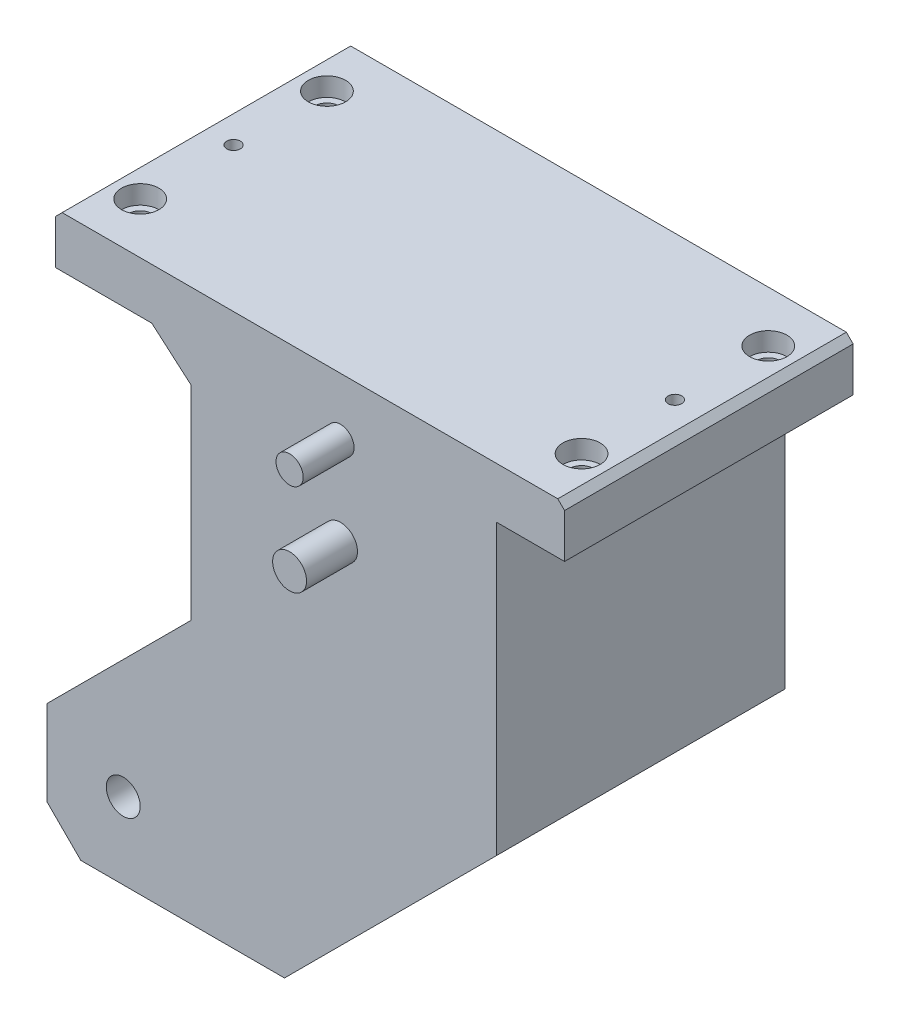
ISO-10303-21;
HEADER;
FILE_DESCRIPTION(('STEP AP214'),'2;1');
FILE_NAME('part.step','',(''),(''),'','','');
FILE_SCHEMA(('AUTOMOTIVE_DESIGN { 1 0 10303 214 1 1 1 1 }'));
ENDSEC;
DATA;
#1=APPLICATION_CONTEXT('core data for automotive mechanical design processes');
#2=APPLICATION_PROTOCOL_DEFINITION('international standard','automotive_design',2000,#1);
#3=PRODUCT_CONTEXT('',#1,'mechanical');
#4=PRODUCT('Part','Part','',(#3));
#5=PRODUCT_RELATED_PRODUCT_CATEGORY('part','',(#4));
#6=PRODUCT_DEFINITION_FORMATION('','',#4);
#7=PRODUCT_DEFINITION_CONTEXT('part definition',#1,'design');
#8=PRODUCT_DEFINITION('design','',#6,#7);
#9=PRODUCT_DEFINITION_SHAPE('','',#8);
#10=(LENGTH_UNIT() NAMED_UNIT(*) SI_UNIT(.MILLI.,.METRE.));
#11=(NAMED_UNIT(*) PLANE_ANGLE_UNIT() SI_UNIT($,.RADIAN.));
#12=(NAMED_UNIT(*) SI_UNIT($,.STERADIAN.) SOLID_ANGLE_UNIT());
#13=UNCERTAINTY_MEASURE_WITH_UNIT(LENGTH_MEASURE(1.E-05),#10,'distance_accuracy_value','');
#14=(GEOMETRIC_REPRESENTATION_CONTEXT(3) GLOBAL_UNCERTAINTY_ASSIGNED_CONTEXT((#13)) GLOBAL_UNIT_ASSIGNED_CONTEXT((#10,
#11,#12)) REPRESENTATION_CONTEXT('',''));
#15=CARTESIAN_POINT('',(0.,0.,0.));
#16=DIRECTION('',(0.,0.,1.));
#17=DIRECTION('',(1.,0.,0.));
#18=AXIS2_PLACEMENT_3D('',#15,#16,#17);
#19=CARTESIAN_POINT('',(56.0000000000004,15.,-15.));
#20=DIRECTION('',(0.,1.,0.));
#21=DIRECTION('',(-1.,0.,0.));
#22=AXIS2_PLACEMENT_3D('',#19,#20,#21);
#23=CYLINDRICAL_SURFACE('',#22,3.50000000000001);
#24=CARTESIAN_POINT('',(56.0000000000004,28.,-15.));
#25=DIRECTION('',(0.,-1.,0.));
#26=DIRECTION('',(0.,0.,-1.));
#27=AXIS2_PLACEMENT_3D('',#24,#25,#26);
#28=CIRCLE('',#27,3.50000000000001);
#29=CARTESIAN_POINT('',(56.0000000000004,28.,-18.5));
#30=VERTEX_POINT('',#29);
#31=EDGE_CURVE('E268',#30,#30,#28,.F.);
#32=ORIENTED_EDGE('',*,*,#31,.F.);
#33=EDGE_LOOP('',(#32));
#34=FACE_BOUND('',#33,.T.);
#35=CARTESIAN_POINT('',(56.0000000000004,37.5,-15.));
#36=DIRECTION('',(0.,1.,0.));
#37=DIRECTION('',(-1.,0.,0.));
#38=AXIS2_PLACEMENT_3D('',#35,#36,#37);
#39=CIRCLE('',#38,3.50000000000001);
#40=CARTESIAN_POINT('',(52.5000000000004,37.5,-15.));
#41=VERTEX_POINT('',#40);
#42=EDGE_CURVE('E39',#41,#41,#39,.T.);
#43=ORIENTED_EDGE('',*,*,#42,.T.);
#44=EDGE_LOOP('',(#43));
#45=FACE_BOUND('',#44,.T.);
#46=ADVANCED_FACE('F35',(#34,#45),#23,.F.);
#47=CARTESIAN_POINT('',(56.0000000000004,15.,-70.));
#48=DIRECTION('',(0.,1.,0.));
#49=DIRECTION('',(-1.,0.,0.));
#50=AXIS2_PLACEMENT_3D('',#47,#48,#49);
#51=CYLINDRICAL_SURFACE('',#50,3.50000000000001);
#52=CARTESIAN_POINT('',(56.0000000000004,28.,-70.));
#53=DIRECTION('',(0.,-1.,0.));
#54=DIRECTION('',(0.,0.,-1.));
#55=AXIS2_PLACEMENT_3D('',#52,#53,#54);
#56=CIRCLE('',#55,3.50000000000001);
#57=CARTESIAN_POINT('',(56.0000000000004,28.,-73.5));
#58=VERTEX_POINT('',#57);
#59=EDGE_CURVE('E260',#58,#58,#56,.F.);
#60=ORIENTED_EDGE('',*,*,#59,.F.);
#61=EDGE_LOOP('',(#60));
#62=FACE_BOUND('',#61,.T.);
#63=CARTESIAN_POINT('',(56.0000000000004,37.5,-70.));
#64=DIRECTION('',(0.,1.,0.));
#65=DIRECTION('',(-1.,0.,0.));
#66=AXIS2_PLACEMENT_3D('',#63,#64,#65);
#67=CIRCLE('',#66,3.50000000000001);
#68=CARTESIAN_POINT('',(52.5000000000004,37.5,-70.));
#69=VERTEX_POINT('',#68);
#70=EDGE_CURVE('E270',#69,#69,#67,.T.);
#71=ORIENTED_EDGE('',*,*,#70,.T.);
#72=EDGE_LOOP('',(#71));
#73=FACE_BOUND('',#72,.T.);
#74=ADVANCED_FACE('F400',(#62,#73),#51,.F.);
#75=CARTESIAN_POINT('',(-73.9999999999995,15.,-15.));
#76=DIRECTION('',(0.,1.,0.));
#77=DIRECTION('',(-1.,0.,0.));
#78=AXIS2_PLACEMENT_3D('',#75,#76,#77);
#79=CYLINDRICAL_SURFACE('',#78,3.50000000000001);
#80=CARTESIAN_POINT('',(-73.9999999999995,28.,-15.));
#81=DIRECTION('',(0.,-1.,0.));
#82=DIRECTION('',(0.,0.,-1.));
#83=AXIS2_PLACEMENT_3D('',#80,#81,#82);
#84=CIRCLE('',#83,3.50000000000001);
#85=CARTESIAN_POINT('',(-73.9999999999995,28.,-18.5));
#86=VERTEX_POINT('',#85);
#87=EDGE_CURVE('E253',#86,#86,#84,.T.);
#88=ORIENTED_EDGE('',*,*,#87,.T.);
#89=EDGE_LOOP('',(#88));
#90=FACE_BOUND('',#89,.T.);
#91=CARTESIAN_POINT('',(-73.9999999999995,37.5,-15.));
#92=DIRECTION('',(0.,1.,0.));
#93=DIRECTION('',(-1.,0.,0.));
#94=AXIS2_PLACEMENT_3D('',#91,#92,#93);
#95=CIRCLE('',#94,3.50000000000001);
#96=CARTESIAN_POINT('',(-77.4999999999995,37.5,-15.));
#97=VERTEX_POINT('',#96);
#98=EDGE_CURVE('E255',#97,#97,#95,.F.);
#99=ORIENTED_EDGE('',*,*,#98,.F.);
#100=EDGE_LOOP('',(#99));
#101=FACE_BOUND('',#100,.T.);
#102=ADVANCED_FACE('F406',(#90,#101),#79,.F.);
#103=CARTESIAN_POINT('',(-73.9999999999995,15.,-70.));
#104=DIRECTION('',(0.,1.,0.));
#105=DIRECTION('',(-1.,0.,0.));
#106=AXIS2_PLACEMENT_3D('',#103,#104,#105);
#107=CYLINDRICAL_SURFACE('',#106,3.50000000000001);
#108=CARTESIAN_POINT('',(-73.9999999999995,28.,-70.));
#109=DIRECTION('',(0.,-1.,0.));
#110=DIRECTION('',(0.,0.,-1.));
#111=AXIS2_PLACEMENT_3D('',#108,#109,#110);
#112=CIRCLE('',#111,3.50000000000001);
#113=CARTESIAN_POINT('',(-73.9999999999995,28.,-73.5));
#114=VERTEX_POINT('',#113);
#115=EDGE_CURVE('E304',#114,#114,#112,.T.);
#116=ORIENTED_EDGE('',*,*,#115,.T.);
#117=EDGE_LOOP('',(#116));
#118=FACE_BOUND('',#117,.T.);
#119=CARTESIAN_POINT('',(-73.9999999999995,37.5,-70.));
#120=DIRECTION('',(0.,1.,0.));
#121=DIRECTION('',(-1.,0.,0.));
#122=AXIS2_PLACEMENT_3D('',#119,#120,#121);
#123=CIRCLE('',#122,3.50000000000001);
#124=CARTESIAN_POINT('',(-77.4999999999995,37.5,-70.));
#125=VERTEX_POINT('',#124);
#126=EDGE_CURVE('E250',#125,#125,#123,.F.);
#127=ORIENTED_EDGE('',*,*,#126,.F.);
#128=EDGE_LOOP('',(#127));
#129=FACE_BOUND('',#128,.T.);
#130=ADVANCED_FACE('F395',(#118,#129),#107,.F.);
#131=CARTESIAN_POINT('',(-9.84077551068508,-11.4243300947287,-85.));
#132=DIRECTION('',(-0.652643387485077,-0.757665235293268,0.));
#133=DIRECTION('',(0.757665235293268,-0.652643387485077,0.));
#134=AXIS2_PLACEMENT_3D('',#131,#132,#133);
#135=PLANE('',#134);
#136=DIRECTION('',(0.757665235293268,-0.652643387485077,0.));
#137=VECTOR('',#136,1.);
#138=CARTESIAN_POINT('',(-9.84077551068508,-11.4243300947287,0.));
#139=LINE('',#138,#137);
#140=CARTESIAN_POINT('',(-55.6091766165418,28.,0.));
#141=VERTEX_POINT('',#140);
#142=CARTESIAN_POINT('',(-43.9999999999995,18.,0.));
#143=VERTEX_POINT('',#142);
#144=EDGE_CURVE('E180',#141,#143,#139,.T.);
#145=ORIENTED_EDGE('',*,*,#144,.F.);
#146=DIRECTION('',(0.,0.,1.));
#147=VECTOR('',#146,1.);
#148=CARTESIAN_POINT('',(-55.6091766165418,28.,-85.));
#149=LINE('',#148,#147);
#150=CARTESIAN_POINT('',(-55.6091766165418,28.,-85.));
#151=VERTEX_POINT('',#150);
#152=EDGE_CURVE('E11',#151,#141,#149,.T.);
#153=ORIENTED_EDGE('',*,*,#152,.F.);
#154=DIRECTION('',(0.757665235293268,-0.652643387485077,0.));
#155=VECTOR('',#154,1.);
#156=CARTESIAN_POINT('',(-9.84077551068508,-11.4243300947287,-85.));
#157=LINE('',#156,#155);
#158=CARTESIAN_POINT('',(-43.9999999999995,18.,-85.));
#159=VERTEX_POINT('',#158);
#160=EDGE_CURVE('E225',#151,#159,#157,.T.);
#161=ORIENTED_EDGE('',*,*,#160,.T.);
#162=DIRECTION('',(0.,0.,1.));
#163=VECTOR('',#162,1.);
#164=CARTESIAN_POINT('',(-43.9999999999995,18.,-85.));
#165=LINE('',#164,#163);
#166=EDGE_CURVE('E113',#159,#143,#165,.T.);
#167=ORIENTED_EDGE('',*,*,#166,.T.);
#168=EDGE_LOOP('',(#145,#153,#161,#167));
#169=FACE_BOUND('',#168,.T.);
#170=ADVANCED_FACE('F37',(#169),#135,.T.);
#171=CARTESIAN_POINT('',(0.,28.,-85.));
#172=DIRECTION('',(0.,-1.,0.));
#173=DIRECTION('',(0.,0.,-1.));
#174=AXIS2_PLACEMENT_3D('',#171,#172,#173);
#175=PLANE('',#174);
#176=ORIENTED_EDGE('',*,*,#87,.F.);
#177=EDGE_LOOP('',(#176));
#178=FACE_BOUND('',#177,.T.);
#179=CARTESIAN_POINT('',(-73.9999999999995,28.,-42.5));
#180=DIRECTION('',(0.,-1.,0.));
#181=DIRECTION('',(0.,0.,-1.));
#182=AXIS2_PLACEMENT_3D('',#179,#180,#181);
#183=CIRCLE('',#182,2.);
#184=CARTESIAN_POINT('',(-73.9999999999995,28.,-44.5));
#185=VERTEX_POINT('',#184);
#186=EDGE_CURVE('E301',#185,#185,#183,.T.);
#187=ORIENTED_EDGE('',*,*,#186,.F.);
#188=EDGE_LOOP('',(#187));
#189=FACE_BOUND('',#188,.T.);
#190=ORIENTED_EDGE('',*,*,#115,.F.);
#191=EDGE_LOOP('',(#190));
#192=FACE_BOUND('',#191,.T.);
#193=DIRECTION('',(1.,0.,0.));
#194=VECTOR('',#193,1.);
#195=CARTESIAN_POINT('',(0.,28.,0.));
#196=LINE('',#195,#194);
#197=CARTESIAN_POINT('',(-83.9999999999995,28.,0.));
#198=VERTEX_POINT('',#197);
#199=EDGE_CURVE('E220',#198,#141,#196,.T.);
#200=ORIENTED_EDGE('',*,*,#199,.F.);
#201=DIRECTION('',(0.,0.,1.));
#202=VECTOR('',#201,1.);
#203=CARTESIAN_POINT('',(-83.9999999999995,28.,-85.));
#204=LINE('',#203,#202);
#205=CARTESIAN_POINT('',(-83.9999999999995,28.,-85.));
#206=VERTEX_POINT('',#205);
#207=EDGE_CURVE('E45',#206,#198,#204,.T.);
#208=ORIENTED_EDGE('',*,*,#207,.F.);
#209=DIRECTION('',(1.,0.,0.));
#210=VECTOR('',#209,1.);
#211=CARTESIAN_POINT('',(0.,28.,-85.));
#212=LINE('',#211,#210);
#213=EDGE_CURVE('E167',#206,#151,#212,.T.);
#214=ORIENTED_EDGE('',*,*,#213,.T.);
#215=ORIENTED_EDGE('',*,*,#152,.T.);
#216=EDGE_LOOP('',(#200,#208,#214,#215));
#217=FACE_BOUND('',#216,.T.);
#218=ADVANCED_FACE('F386',(#178,#189,#192,#217),#175,.T.);
#219=CARTESIAN_POINT('',(-83.9999999999995,0.,-85.));
#220=DIRECTION('',(-1.,0.,0.));
#221=DIRECTION('',(0.,0.,1.));
#222=AXIS2_PLACEMENT_3D('',#219,#220,#221);
#223=PLANE('',#222);
#224=DIRECTION('',(0.,-1.,0.));
#225=VECTOR('',#224,1.);
#226=CARTESIAN_POINT('',(-83.9999999999995,0.,0.));
#227=LINE('',#226,#225);
#228=CARTESIAN_POINT('',(-83.9999999999995,41.,0.));
#229=VERTEX_POINT('',#228);
#230=EDGE_CURVE('E153',#229,#198,#227,.T.);
#231=ORIENTED_EDGE('',*,*,#230,.F.);
#232=DIRECTION('',(0.,0.,1.));
#233=VECTOR('',#232,1.);
#234=CARTESIAN_POINT('',(-83.9999999999995,41.,-85.));
#235=LINE('',#234,#233);
#236=CARTESIAN_POINT('',(-83.9999999999995,41.,-85.));
#237=VERTEX_POINT('',#236);
#238=EDGE_CURVE('E148',#237,#229,#235,.T.);
#239=ORIENTED_EDGE('',*,*,#238,.F.);
#240=DIRECTION('',(0.,-1.,0.));
#241=VECTOR('',#240,1.);
#242=CARTESIAN_POINT('',(-83.9999999999995,0.,-85.));
#243=LINE('',#242,#241);
#244=EDGE_CURVE('E151',#237,#206,#243,.T.);
#245=ORIENTED_EDGE('',*,*,#244,.T.);
#246=ORIENTED_EDGE('',*,*,#207,.T.);
#247=EDGE_LOOP('',(#231,#239,#245,#246));
#248=FACE_BOUND('',#247,.T.);
#249=ADVANCED_FACE('F150',(#248),#223,.T.);
#250=CARTESIAN_POINT('',(-62.4999999999999,62.4999999999997,-85.));
#251=DIRECTION('',(-0.707106781186549,0.707106781186546,0.));
#252=DIRECTION('',(-0.707106781186546,-0.707106781186549,0.));
#253=AXIS2_PLACEMENT_3D('',#250,#251,#252);
#254=PLANE('',#253);
#255=DIRECTION('',(-0.707106781186546,-0.707106781186549,0.));
#256=VECTOR('',#255,1.);
#257=CARTESIAN_POINT('',(-62.4999999999999,62.4999999999997,0.));
#258=LINE('',#257,#256);
#259=CARTESIAN_POINT('',(-81.9999999999995,43.,0.));
#260=VERTEX_POINT('',#259);
#261=EDGE_CURVE('E217',#260,#229,#258,.T.);
#262=ORIENTED_EDGE('',*,*,#261,.F.);
#263=DIRECTION('',(0.,0.,1.));
#264=VECTOR('',#263,1.);
#265=CARTESIAN_POINT('',(-81.9999999999995,43.,-85.));
#266=LINE('',#265,#264);
#267=CARTESIAN_POINT('',(-81.9999999999995,43.,-85.));
#268=VERTEX_POINT('',#267);
#269=EDGE_CURVE('E158',#268,#260,#266,.T.);
#270=ORIENTED_EDGE('',*,*,#269,.F.);
#271=DIRECTION('',(-0.707106781186546,-0.707106781186549,0.));
#272=VECTOR('',#271,1.);
#273=CARTESIAN_POINT('',(-62.4999999999999,62.4999999999997,-85.));
#274=LINE('',#273,#272);
#275=EDGE_CURVE('E165',#268,#237,#274,.T.);
#276=ORIENTED_EDGE('',*,*,#275,.T.);
#277=ORIENTED_EDGE('',*,*,#238,.T.);
#278=EDGE_LOOP('',(#262,#270,#276,#277));
#279=FACE_BOUND('',#278,.T.);
#280=ADVANCED_FACE('F169',(#279),#254,.T.);
#281=CARTESIAN_POINT('',(0.,43.,-85.));
#282=DIRECTION('',(0.,1.,0.));
#283=DIRECTION('',(-1.,0.,0.));
#284=AXIS2_PLACEMENT_3D('',#281,#282,#283);
#285=PLANE('',#284);
#286=CARTESIAN_POINT('',(56.0000000000004,43.,-15.));
#287=DIRECTION('',(0.,-1.,0.));
#288=DIRECTION('',(1.,0.,0.));
#289=AXIS2_PLACEMENT_3D('',#286,#287,#288);
#290=CIRCLE('',#289,5.5);
#291=CARTESIAN_POINT('',(61.5000000000004,43.,-15.));
#292=VERTEX_POINT('',#291);
#293=EDGE_CURVE('E283',#292,#292,#290,.T.);
#294=ORIENTED_EDGE('',*,*,#293,.T.);
#295=EDGE_LOOP('',(#294));
#296=FACE_BOUND('',#295,.T.);
#297=CARTESIAN_POINT('',(56.0000000000004,43.,-70.));
#298=DIRECTION('',(0.,-1.,0.));
#299=DIRECTION('',(1.,0.,0.));
#300=AXIS2_PLACEMENT_3D('',#297,#298,#299);
#301=CIRCLE('',#300,5.5);
#302=CARTESIAN_POINT('',(61.5000000000004,43.,-70.));
#303=VERTEX_POINT('',#302);
#304=EDGE_CURVE('E276',#303,#303,#301,.T.);
#305=ORIENTED_EDGE('',*,*,#304,.T.);
#306=EDGE_LOOP('',(#305));
#307=FACE_BOUND('',#306,.T.);
#308=CARTESIAN_POINT('',(56.0000000000004,43.,-42.5));
#309=DIRECTION('',(0.,-1.,0.));
#310=DIRECTION('',(1.,0.,0.));
#311=AXIS2_PLACEMENT_3D('',#308,#309,#310);
#312=CIRCLE('',#311,2.);
#313=CARTESIAN_POINT('',(58.0000000000004,43.,-42.5));
#314=VERTEX_POINT('',#313);
#315=EDGE_CURVE('E267',#314,#314,#312,.T.);
#316=ORIENTED_EDGE('',*,*,#315,.T.);
#317=EDGE_LOOP('',(#316));
#318=FACE_BOUND('',#317,.T.);
#319=CARTESIAN_POINT('',(-73.9999999999995,43.,-15.));
#320=DIRECTION('',(0.,1.,0.));
#321=DIRECTION('',(-1.,0.,0.));
#322=AXIS2_PLACEMENT_3D('',#319,#320,#321);
#323=CIRCLE('',#322,5.5);
#324=CARTESIAN_POINT('',(-79.4999999999995,43.,-15.));
#325=VERTEX_POINT('',#324);
#326=EDGE_CURVE('E263',#325,#325,#323,.T.);
#327=ORIENTED_EDGE('',*,*,#326,.F.);
#328=EDGE_LOOP('',(#327));
#329=FACE_BOUND('',#328,.T.);
#330=CARTESIAN_POINT('',(-73.9999999999995,43.,-70.));
#331=DIRECTION('',(0.,1.,0.));
#332=DIRECTION('',(-1.,0.,0.));
#333=AXIS2_PLACEMENT_3D('',#330,#331,#332);
#334=CIRCLE('',#333,5.5);
#335=CARTESIAN_POINT('',(-79.4999999999995,43.,-70.));
#336=VERTEX_POINT('',#335);
#337=EDGE_CURVE('E258',#336,#336,#334,.T.);
#338=ORIENTED_EDGE('',*,*,#337,.F.);
#339=EDGE_LOOP('',(#338));
#340=FACE_BOUND('',#339,.T.);
#341=CARTESIAN_POINT('',(-73.9999999999995,43.,-42.5));
#342=DIRECTION('',(0.,1.,0.));
#343=DIRECTION('',(-1.,0.,0.));
#344=AXIS2_PLACEMENT_3D('',#341,#342,#343);
#345=CIRCLE('',#344,2.);
#346=CARTESIAN_POINT('',(-75.9999999999995,43.,-42.5));
#347=VERTEX_POINT('',#346);
#348=EDGE_CURVE('E298',#347,#347,#345,.T.);
#349=ORIENTED_EDGE('',*,*,#348,.F.);
#350=EDGE_LOOP('',(#349));
#351=FACE_BOUND('',#350,.T.);
#352=DIRECTION('',(-1.,0.,0.));
#353=VECTOR('',#352,1.);
#354=CARTESIAN_POINT('',(0.,43.,0.));
#355=LINE('',#354,#353);
#356=CARTESIAN_POINT('',(64.0000000000005,43.,0.));
#357=VERTEX_POINT('',#356);
#358=EDGE_CURVE('E214',#357,#260,#355,.T.);
#359=ORIENTED_EDGE('',*,*,#358,.F.);
#360=DIRECTION('',(0.,0.,1.));
#361=VECTOR('',#360,1.);
#362=CARTESIAN_POINT('',(64.0000000000005,43.,-85.));
#363=LINE('',#362,#361);
#364=CARTESIAN_POINT('',(64.0000000000005,43.,-85.));
#365=VERTEX_POINT('',#364);
#366=EDGE_CURVE('E229',#365,#357,#363,.T.);
#367=ORIENTED_EDGE('',*,*,#366,.F.);
#368=DIRECTION('',(-1.,0.,0.));
#369=VECTOR('',#368,1.);
#370=CARTESIAN_POINT('',(0.,43.,-85.));
#371=LINE('',#370,#369);
#372=EDGE_CURVE('E170',#365,#268,#371,.T.);
#373=ORIENTED_EDGE('',*,*,#372,.T.);
#374=ORIENTED_EDGE('',*,*,#269,.T.);
#375=EDGE_LOOP('',(#359,#367,#373,#374));
#376=FACE_BOUND('',#375,.T.);
#377=ADVANCED_FACE('F496',(#296,#307,#318,#329,#340,#351,#376),#285,.T.);
#378=CARTESIAN_POINT('',(53.5000000000001,53.5000000000003,-85.));
#379=DIRECTION('',(0.707106781186546,0.707106781186549,0.));
#380=DIRECTION('',(-0.707106781186549,0.707106781186546,0.));
#381=AXIS2_PLACEMENT_3D('',#378,#379,#380);
#382=PLANE('',#381);
#383=DIRECTION('',(-0.707106781186549,0.707106781186546,0.));
#384=VECTOR('',#383,1.);
#385=CARTESIAN_POINT('',(53.5000000000001,53.5000000000003,0.));
#386=LINE('',#385,#384);
#387=CARTESIAN_POINT('',(66.0000000000005,41.,0.));
#388=VERTEX_POINT('',#387);
#389=EDGE_CURVE('E211',#388,#357,#386,.T.);
#390=ORIENTED_EDGE('',*,*,#389,.F.);
#391=DIRECTION('',(0.,0.,1.));
#392=VECTOR('',#391,1.);
#393=CARTESIAN_POINT('',(66.0000000000005,41.,-85.));
#394=LINE('',#393,#392);
#395=CARTESIAN_POINT('',(66.0000000000005,41.,-85.));
#396=VERTEX_POINT('',#395);
#397=EDGE_CURVE('E231',#396,#388,#394,.T.);
#398=ORIENTED_EDGE('',*,*,#397,.F.);
#399=DIRECTION('',(-0.707106781186549,0.707106781186546,0.));
#400=VECTOR('',#399,1.);
#401=CARTESIAN_POINT('',(53.5000000000001,53.5000000000003,-85.));
#402=LINE('',#401,#400);
#403=EDGE_CURVE('E172',#396,#365,#402,.T.);
#404=ORIENTED_EDGE('',*,*,#403,.T.);
#405=ORIENTED_EDGE('',*,*,#366,.T.);
#406=EDGE_LOOP('',(#390,#398,#404,#405));
#407=FACE_BOUND('',#406,.T.);
#408=ADVANCED_FACE('F348',(#407),#382,.T.);
#409=CARTESIAN_POINT('',(66.0000000000005,0.,-85.));
#410=DIRECTION('',(1.,0.,0.));
#411=DIRECTION('',(0.,0.,-1.));
#412=AXIS2_PLACEMENT_3D('',#409,#410,#411);
#413=PLANE('',#412);
#414=DIRECTION('',(0.,1.,0.));
#415=VECTOR('',#414,1.);
#416=CARTESIAN_POINT('',(66.0000000000005,0.,0.));
#417=LINE('',#416,#415);
#418=CARTESIAN_POINT('',(66.0000000000005,28.,0.));
#419=VERTEX_POINT('',#418);
#420=EDGE_CURVE('E208',#419,#388,#417,.T.);
#421=ORIENTED_EDGE('',*,*,#420,.F.);
#422=DIRECTION('',(0.,0.,1.));
#423=VECTOR('',#422,1.);
#424=CARTESIAN_POINT('',(66.0000000000005,28.,-85.));
#425=LINE('',#424,#423);
#426=CARTESIAN_POINT('',(66.0000000000005,28.,-85.));
#427=VERTEX_POINT('',#426);
#428=EDGE_CURVE('E233',#427,#419,#425,.T.);
#429=ORIENTED_EDGE('',*,*,#428,.F.);
#430=DIRECTION('',(0.,1.,0.));
#431=VECTOR('',#430,1.);
#432=CARTESIAN_POINT('',(66.0000000000005,0.,-85.));
#433=LINE('',#432,#431);
#434=EDGE_CURVE('E342',#427,#396,#433,.T.);
#435=ORIENTED_EDGE('',*,*,#434,.T.);
#436=ORIENTED_EDGE('',*,*,#397,.T.);
#437=EDGE_LOOP('',(#421,#429,#435,#436));
#438=FACE_BOUND('',#437,.T.);
#439=ADVANCED_FACE('F354',(#438),#413,.T.);
#440=CARTESIAN_POINT('',(0.,28.,-85.));
#441=DIRECTION('',(0.,-1.,0.));
#442=DIRECTION('',(0.,0.,-1.));
#443=AXIS2_PLACEMENT_3D('',#440,#441,#442);
#444=PLANE('',#443);
#445=ORIENTED_EDGE('',*,*,#31,.T.);
#446=EDGE_LOOP('',(#445));
#447=FACE_BOUND('',#446,.T.);
#448=CARTESIAN_POINT('',(56.0000000000004,28.,-42.5));
#449=DIRECTION('',(0.,-1.,0.));
#450=DIRECTION('',(0.,0.,-1.));
#451=AXIS2_PLACEMENT_3D('',#448,#449,#450);
#452=CIRCLE('',#451,2.);
#453=CARTESIAN_POINT('',(56.0000000000004,28.,-44.5));
#454=VERTEX_POINT('',#453);
#455=EDGE_CURVE('E264',#454,#454,#452,.F.);
#456=ORIENTED_EDGE('',*,*,#455,.T.);
#457=EDGE_LOOP('',(#456));
#458=FACE_BOUND('',#457,.T.);
#459=ORIENTED_EDGE('',*,*,#59,.T.);
#460=EDGE_LOOP('',(#459));
#461=FACE_BOUND('',#460,.T.);
#462=DIRECTION('',(1.,0.,0.));
#463=VECTOR('',#462,1.);
#464=CARTESIAN_POINT('',(0.,28.,0.));
#465=LINE('',#464,#463);
#466=CARTESIAN_POINT('',(46.0000000000005,28.,0.));
#467=VERTEX_POINT('',#466);
#468=EDGE_CURVE('E205',#467,#419,#465,.T.);
#469=ORIENTED_EDGE('',*,*,#468,.F.);
#470=DIRECTION('',(0.,0.,1.));
#471=VECTOR('',#470,1.);
#472=CARTESIAN_POINT('',(46.0000000000005,28.,-85.));
#473=LINE('',#472,#471);
#474=CARTESIAN_POINT('',(46.0000000000005,28.,-85.));
#475=VERTEX_POINT('',#474);
#476=EDGE_CURVE('E235',#475,#467,#473,.T.);
#477=ORIENTED_EDGE('',*,*,#476,.F.);
#478=DIRECTION('',(1.,0.,0.));
#479=VECTOR('',#478,1.);
#480=CARTESIAN_POINT('',(0.,28.,-85.));
#481=LINE('',#480,#479);
#482=EDGE_CURVE('E339',#475,#427,#481,.T.);
#483=ORIENTED_EDGE('',*,*,#482,.T.);
#484=ORIENTED_EDGE('',*,*,#428,.T.);
#485=EDGE_LOOP('',(#469,#477,#483,#484));
#486=FACE_BOUND('',#485,.T.);
#487=ADVANCED_FACE('F357',(#447,#458,#461,#486),#444,.T.);
#488=CARTESIAN_POINT('',(46.0000000000005,0.,-85.));
#489=DIRECTION('',(1.,0.,0.));
#490=DIRECTION('',(0.,0.,-1.));
#491=AXIS2_PLACEMENT_3D('',#488,#489,#490);
#492=PLANE('',#491);
#493=DIRECTION('',(0.,1.,0.));
#494=VECTOR('',#493,1.);
#495=CARTESIAN_POINT('',(46.0000000000005,0.,0.));
#496=LINE('',#495,#494);
#497=CARTESIAN_POINT('',(46.0000000000005,-57.,0.));
#498=VERTEX_POINT('',#497);
#499=EDGE_CURVE('E202',#498,#467,#496,.T.);
#500=ORIENTED_EDGE('',*,*,#499,.F.);
#501=DIRECTION('',(0.,0.,1.));
#502=VECTOR('',#501,1.);
#503=CARTESIAN_POINT('',(46.0000000000005,-57.,-85.));
#504=LINE('',#503,#502);
#505=CARTESIAN_POINT('',(46.0000000000005,-57.,-85.));
#506=VERTEX_POINT('',#505);
#507=EDGE_CURVE('E237',#506,#498,#504,.T.);
#508=ORIENTED_EDGE('',*,*,#507,.F.);
#509=DIRECTION('',(0.,1.,0.));
#510=VECTOR('',#509,1.);
#511=CARTESIAN_POINT('',(46.0000000000005,0.,-85.));
#512=LINE('',#511,#510);
#513=EDGE_CURVE('E336',#506,#475,#512,.T.);
#514=ORIENTED_EDGE('',*,*,#513,.T.);
#515=ORIENTED_EDGE('',*,*,#476,.T.);
#516=EDGE_LOOP('',(#500,#508,#514,#515));
#517=FACE_BOUND('',#516,.T.);
#518=ADVANCED_FACE('F362',(#517),#492,.T.);
#519=CARTESIAN_POINT('',(51.5,-51.5000000000006,-85.));
#520=DIRECTION('',(0.707106781186543,-0.707106781186551,0.));
#521=DIRECTION('',(0.707106781186552,0.707106781186544,0.));
#522=AXIS2_PLACEMENT_3D('',#519,#520,#521);
#523=PLANE('',#522);
#524=DIRECTION('',(0.707106781186552,0.707106781186544,0.));
#525=VECTOR('',#524,1.);
#526=CARTESIAN_POINT('',(51.5,-51.5000000000006,0.));
#527=LINE('',#526,#525);
#528=CARTESIAN_POINT('',(-16.5000000000003,-119.5,0.));
#529=VERTEX_POINT('',#528);
#530=EDGE_CURVE('E199',#529,#498,#527,.T.);
#531=ORIENTED_EDGE('',*,*,#530,.F.);
#532=DIRECTION('',(0.,0.,1.));
#533=VECTOR('',#532,1.);
#534=CARTESIAN_POINT('',(-16.5000000000003,-119.5,-85.));
#535=LINE('',#534,#533);
#536=CARTESIAN_POINT('',(-16.5000000000003,-119.5,-85.));
#537=VERTEX_POINT('',#536);
#538=EDGE_CURVE('E239',#537,#529,#535,.T.);
#539=ORIENTED_EDGE('',*,*,#538,.F.);
#540=DIRECTION('',(0.707106781186552,0.707106781186544,0.));
#541=VECTOR('',#540,1.);
#542=CARTESIAN_POINT('',(51.5,-51.5000000000006,-85.));
#543=LINE('',#542,#541);
#544=EDGE_CURVE('E333',#537,#506,#543,.T.);
#545=ORIENTED_EDGE('',*,*,#544,.T.);
#546=ORIENTED_EDGE('',*,*,#507,.T.);
#547=EDGE_LOOP('',(#531,#539,#545,#546));
#548=FACE_BOUND('',#547,.T.);
#549=ADVANCED_FACE('F365',(#548),#523,.T.);
#550=CARTESIAN_POINT('',(0.,-119.5,-85.));
#551=DIRECTION('',(0.,-1.,0.));
#552=DIRECTION('',(0.,0.,-1.));
#553=AXIS2_PLACEMENT_3D('',#550,#551,#552);
#554=PLANE('',#553);
#555=DIRECTION('',(1.,0.,0.));
#556=VECTOR('',#555,1.);
#557=CARTESIAN_POINT('',(0.,-119.5,0.));
#558=LINE('',#557,#556);
#559=CARTESIAN_POINT('',(-76.5000000000001,-119.5,0.));
#560=VERTEX_POINT('',#559);
#561=EDGE_CURVE('E196',#560,#529,#558,.T.);
#562=ORIENTED_EDGE('',*,*,#561,.F.);
#563=DIRECTION('',(0.,0.,1.));
#564=VECTOR('',#563,1.);
#565=CARTESIAN_POINT('',(-76.5000000000001,-119.5,-85.));
#566=LINE('',#565,#564);
#567=CARTESIAN_POINT('',(-76.5000000000001,-119.5,-85.));
#568=VERTEX_POINT('',#567);
#569=EDGE_CURVE('E241',#568,#560,#566,.T.);
#570=ORIENTED_EDGE('',*,*,#569,.F.);
#571=DIRECTION('',(1.,0.,0.));
#572=VECTOR('',#571,1.);
#573=CARTESIAN_POINT('',(0.,-119.5,-85.));
#574=LINE('',#573,#572);
#575=EDGE_CURVE('E330',#568,#537,#574,.T.);
#576=ORIENTED_EDGE('',*,*,#575,.T.);
#577=ORIENTED_EDGE('',*,*,#538,.T.);
#578=EDGE_LOOP('',(#562,#570,#576,#577));
#579=FACE_BOUND('',#578,.T.);
#580=ADVANCED_FACE('F370',(#579),#554,.T.);
#581=CARTESIAN_POINT('',(-98.0000000000002,-97.9999999999998,-85.));
#582=DIRECTION('',(-0.707106781186549,-0.707106781186546,0.));
#583=DIRECTION('',(0.707106781186546,-0.707106781186549,0.));
#584=AXIS2_PLACEMENT_3D('',#581,#582,#583);
#585=PLANE('',#584);
#586=DIRECTION('',(0.707106781186546,-0.707106781186549,0.));
#587=VECTOR('',#586,1.);
#588=CARTESIAN_POINT('',(-98.0000000000002,-97.9999999999998,0.));
#589=LINE('',#588,#587);
#590=CARTESIAN_POINT('',(-86.5,-109.5,0.));
#591=VERTEX_POINT('',#590);
#592=EDGE_CURVE('E193',#591,#560,#589,.T.);
#593=ORIENTED_EDGE('',*,*,#592,.F.);
#594=DIRECTION('',(0.,0.,1.));
#595=VECTOR('',#594,1.);
#596=CARTESIAN_POINT('',(-86.5,-109.5,-85.));
#597=LINE('',#596,#595);
#598=CARTESIAN_POINT('',(-86.5,-109.5,-85.));
#599=VERTEX_POINT('',#598);
#600=EDGE_CURVE('E243',#599,#591,#597,.T.);
#601=ORIENTED_EDGE('',*,*,#600,.F.);
#602=DIRECTION('',(0.707106781186546,-0.707106781186549,0.));
#603=VECTOR('',#602,1.);
#604=CARTESIAN_POINT('',(-98.0000000000002,-97.9999999999998,-85.));
#605=LINE('',#604,#603);
#606=EDGE_CURVE('E327',#599,#568,#605,.T.);
#607=ORIENTED_EDGE('',*,*,#606,.T.);
#608=ORIENTED_EDGE('',*,*,#569,.T.);
#609=EDGE_LOOP('',(#593,#601,#607,#608));
#610=FACE_BOUND('',#609,.T.);
#611=ADVANCED_FACE('F373',(#610),#585,.T.);
#612=CARTESIAN_POINT('',(-86.5,0.,-85.));
#613=DIRECTION('',(-1.,0.,0.));
#614=DIRECTION('',(0.,0.,1.));
#615=AXIS2_PLACEMENT_3D('',#612,#613,#614);
#616=PLANE('',#615);
#617=DIRECTION('',(0.,-1.,0.));
#618=VECTOR('',#617,1.);
#619=CARTESIAN_POINT('',(-86.5,0.,0.));
#620=LINE('',#619,#618);
#621=CARTESIAN_POINT('',(-86.5,-84.5,0.));
#622=VERTEX_POINT('',#621);
#623=EDGE_CURVE('E190',#622,#591,#620,.T.);
#624=ORIENTED_EDGE('',*,*,#623,.F.);
#625=DIRECTION('',(0.,0.,1.));
#626=VECTOR('',#625,1.);
#627=CARTESIAN_POINT('',(-86.5,-84.5,-85.));
#628=LINE('',#627,#626);
#629=CARTESIAN_POINT('',(-86.5,-84.5,-85.));
#630=VERTEX_POINT('',#629);
#631=EDGE_CURVE('E245',#630,#622,#628,.T.);
#632=ORIENTED_EDGE('',*,*,#631,.F.);
#633=DIRECTION('',(0.,-1.,0.));
#634=VECTOR('',#633,1.);
#635=CARTESIAN_POINT('',(-86.5,0.,-85.));
#636=LINE('',#635,#634);
#637=EDGE_CURVE('E324',#630,#599,#636,.T.);
#638=ORIENTED_EDGE('',*,*,#637,.T.);
#639=ORIENTED_EDGE('',*,*,#600,.T.);
#640=EDGE_LOOP('',(#624,#632,#638,#639));
#641=FACE_BOUND('',#640,.T.);
#642=ADVANCED_FACE('F378',(#641),#616,.T.);
#643=CARTESIAN_POINT('',(-0.999999999999495,0.999999999999507,-85.));
#644=DIRECTION('',(-0.707106781186543,0.707106781186551,0.));
#645=DIRECTION('',(-0.707106781186552,-0.707106781186544,0.));
#646=AXIS2_PLACEMENT_3D('',#643,#644,#645);
#647=PLANE('',#646);
#648=DIRECTION('',(-0.707106781186552,-0.707106781186544,0.));
#649=VECTOR('',#648,1.);
#650=CARTESIAN_POINT('',(-0.999999999999495,0.999999999999507,0.));
#651=LINE('',#650,#649);
#652=CARTESIAN_POINT('',(-43.9999999999995,-42.,0.));
#653=VERTEX_POINT('',#652);
#654=EDGE_CURVE('E187',#653,#622,#651,.T.);
#655=ORIENTED_EDGE('',*,*,#654,.F.);
#656=DIRECTION('',(0.,0.,1.));
#657=VECTOR('',#656,1.);
#658=CARTESIAN_POINT('',(-43.9999999999995,-42.,-85.));
#659=LINE('',#658,#657);
#660=CARTESIAN_POINT('',(-43.9999999999995,-42.,-85.));
#661=VERTEX_POINT('',#660);
#662=EDGE_CURVE('E247',#661,#653,#659,.T.);
#663=ORIENTED_EDGE('',*,*,#662,.F.);
#664=DIRECTION('',(-0.707106781186552,-0.707106781186544,0.));
#665=VECTOR('',#664,1.);
#666=CARTESIAN_POINT('',(-0.999999999999495,0.999999999999507,-85.));
#667=LINE('',#666,#665);
#668=EDGE_CURVE('E321',#661,#630,#667,.T.);
#669=ORIENTED_EDGE('',*,*,#668,.T.);
#670=ORIENTED_EDGE('',*,*,#631,.T.);
#671=EDGE_LOOP('',(#655,#663,#669,#670));
#672=FACE_BOUND('',#671,.T.);
#673=ADVANCED_FACE('F381',(#672),#647,.T.);
#674=CARTESIAN_POINT('',(-43.9999999999995,0.,-85.));
#675=DIRECTION('',(-1.,0.,0.));
#676=DIRECTION('',(0.,-1.,0.));
#677=AXIS2_PLACEMENT_3D('',#674,#675,#676);
#678=PLANE('',#677);
#679=DIRECTION('',(0.,-1.,0.));
#680=VECTOR('',#679,1.);
#681=CARTESIAN_POINT('',(-43.9999999999995,0.,0.));
#682=LINE('',#681,#680);
#683=EDGE_CURVE('E183',#143,#653,#682,.T.);
#684=ORIENTED_EDGE('',*,*,#683,.F.);
#685=ORIENTED_EDGE('',*,*,#166,.F.);
#686=DIRECTION('',(0.,-1.,0.));
#687=VECTOR('',#686,1.);
#688=CARTESIAN_POINT('',(-43.9999999999995,0.,-85.));
#689=LINE('',#688,#687);
#690=EDGE_CURVE('E319',#159,#661,#689,.T.);
#691=ORIENTED_EDGE('',*,*,#690,.T.);
#692=ORIENTED_EDGE('',*,*,#662,.T.);
#693=EDGE_LOOP('',(#684,#685,#691,#692));
#694=FACE_BOUND('',#693,.T.);
#695=ADVANCED_FACE('F382',(#694),#678,.T.);
#696=CARTESIAN_POINT('',(-64.,-97.,-85.));
#697=DIRECTION('',(0.,0.,1.));
#698=DIRECTION('',(1.,0.,0.));
#699=AXIS2_PLACEMENT_3D('',#696,#697,#698);
#700=CYLINDRICAL_SURFACE('',#699,5.00000000000001);
#701=CARTESIAN_POINT('',(-64.,-97.,-85.));
#702=DIRECTION('',(0.,0.,1.));
#703=DIRECTION('',(1.,0.,0.));
#704=AXIS2_PLACEMENT_3D('',#701,#702,#703);
#705=CIRCLE('',#704,5.00000000000001);
#706=CARTESIAN_POINT('',(-59.,-97.,-85.));
#707=VERTEX_POINT('',#706);
#708=EDGE_CURVE('E177',#707,#707,#705,.T.);
#709=ORIENTED_EDGE('',*,*,#708,.F.);
#710=EDGE_LOOP('',(#709));
#711=FACE_BOUND('',#710,.T.);
#712=CARTESIAN_POINT('',(-64.,-97.,0.));
#713=DIRECTION('',(0.,0.,1.));
#714=DIRECTION('',(1.,0.,0.));
#715=AXIS2_PLACEMENT_3D('',#712,#713,#714);
#716=CIRCLE('',#715,5.00000000000001);
#717=CARTESIAN_POINT('',(-59.,-97.,0.));
#718=VERTEX_POINT('',#717);
#719=EDGE_CURVE('E223',#718,#718,#716,.T.);
#720=ORIENTED_EDGE('',*,*,#719,.T.);
#721=EDGE_LOOP('',(#720));
#722=FACE_BOUND('',#721,.T.);
#723=ADVANCED_FACE('F463',(#711,#722),#700,.F.);
#724=CARTESIAN_POINT('',(0.,0.,-85.));
#725=DIRECTION('',(0.,0.,1.));
#726=DIRECTION('',(1.,0.,0.));
#727=AXIS2_PLACEMENT_3D('',#724,#725,#726);
#728=PLANE('',#727);
#729=ORIENTED_EDGE('',*,*,#160,.F.);
#730=ORIENTED_EDGE('',*,*,#213,.F.);
#731=ORIENTED_EDGE('',*,*,#244,.F.);
#732=ORIENTED_EDGE('',*,*,#275,.F.);
#733=ORIENTED_EDGE('',*,*,#372,.F.);
#734=ORIENTED_EDGE('',*,*,#403,.F.);
#735=ORIENTED_EDGE('',*,*,#434,.F.);
#736=ORIENTED_EDGE('',*,*,#482,.F.);
#737=ORIENTED_EDGE('',*,*,#513,.F.);
#738=ORIENTED_EDGE('',*,*,#544,.F.);
#739=ORIENTED_EDGE('',*,*,#575,.F.);
#740=ORIENTED_EDGE('',*,*,#606,.F.);
#741=ORIENTED_EDGE('',*,*,#637,.F.);
#742=ORIENTED_EDGE('',*,*,#668,.F.);
#743=ORIENTED_EDGE('',*,*,#690,.F.);
#744=EDGE_LOOP('',(#729,#730,#731,#732,#733,#734,#735,#736,#737,#738,#739,#740,#741,#742,#743));
#745=FACE_BOUND('',#744,.T.);
#746=ORIENTED_EDGE('',*,*,#708,.T.);
#747=EDGE_LOOP('',(#746));
#748=FACE_BOUND('',#747,.T.);
#749=ADVANCED_FACE('F162',(#745,#748),#728,.F.);
#750=CARTESIAN_POINT('',(0.,0.,0.));
#751=DIRECTION('',(0.,0.,1.));
#752=DIRECTION('',(1.,0.,0.));
#753=AXIS2_PLACEMENT_3D('',#750,#751,#752);
#754=PLANE('',#753);
#755=CARTESIAN_POINT('',(0.,26.,0.));
#756=DIRECTION('',(0.,0.,1.));
#757=DIRECTION('',(1.,0.,0.));
#758=AXIS2_PLACEMENT_3D('',#755,#756,#757);
#759=CIRCLE('',#758,4.);
#760=CARTESIAN_POINT('',(4.,26.,0.));
#761=VERTEX_POINT('',#760);
#762=EDGE_CURVE('E307',#761,#761,#759,.T.);
#763=ORIENTED_EDGE('',*,*,#762,.F.);
#764=EDGE_LOOP('',(#763));
#765=FACE_BOUND('',#764,.T.);
#766=CARTESIAN_POINT('',(0.,0.,0.));
#767=DIRECTION('',(0.,0.,1.));
#768=DIRECTION('',(1.,0.,0.));
#769=AXIS2_PLACEMENT_3D('',#766,#767,#768);
#770=CIRCLE('',#769,5.);
#771=CARTESIAN_POINT('',(5.,0.,0.));
#772=VERTEX_POINT('',#771);
#773=EDGE_CURVE('E311',#772,#772,#770,.T.);
#774=ORIENTED_EDGE('',*,*,#773,.F.);
#775=EDGE_LOOP('',(#774));
#776=FACE_BOUND('',#775,.T.);
#777=ORIENTED_EDGE('',*,*,#144,.T.);
#778=ORIENTED_EDGE('',*,*,#683,.T.);
#779=ORIENTED_EDGE('',*,*,#654,.T.);
#780=ORIENTED_EDGE('',*,*,#623,.T.);
#781=ORIENTED_EDGE('',*,*,#592,.T.);
#782=ORIENTED_EDGE('',*,*,#561,.T.);
#783=ORIENTED_EDGE('',*,*,#530,.T.);
#784=ORIENTED_EDGE('',*,*,#499,.T.);
#785=ORIENTED_EDGE('',*,*,#468,.T.);
#786=ORIENTED_EDGE('',*,*,#420,.T.);
#787=ORIENTED_EDGE('',*,*,#389,.T.);
#788=ORIENTED_EDGE('',*,*,#358,.T.);
#789=ORIENTED_EDGE('',*,*,#261,.T.);
#790=ORIENTED_EDGE('',*,*,#230,.T.);
#791=ORIENTED_EDGE('',*,*,#199,.T.);
#792=EDGE_LOOP('',(#777,#778,#779,#780,#781,#782,#783,#784,#785,#786,#787,#788,#789,#790,#791));
#793=FACE_BOUND('',#792,.T.);
#794=ORIENTED_EDGE('',*,*,#719,.F.);
#795=EDGE_LOOP('',(#794));
#796=FACE_BOUND('',#795,.T.);
#797=ADVANCED_FACE('F384',(#765,#776,#793,#796),#754,.T.);
#798=CARTESIAN_POINT('',(0.,0.,15.));
#799=DIRECTION('',(0.,0.,-1.));
#800=DIRECTION('',(-1.,0.,0.));
#801=AXIS2_PLACEMENT_3D('',#798,#799,#800);
#802=CYLINDRICAL_SURFACE('',#801,5.);
#803=CARTESIAN_POINT('',(0.,0.,15.));
#804=DIRECTION('',(0.,0.,1.));
#805=DIRECTION('',(1.,0.,0.));
#806=AXIS2_PLACEMENT_3D('',#803,#804,#805);
#807=CIRCLE('',#806,5.);
#808=CARTESIAN_POINT('',(5.,0.,15.));
#809=VERTEX_POINT('',#808);
#810=EDGE_CURVE('E184',#809,#809,#807,.T.);
#811=ORIENTED_EDGE('',*,*,#810,.F.);
#812=EDGE_LOOP('',(#811));
#813=FACE_BOUND('',#812,.T.);
#814=ORIENTED_EDGE('',*,*,#773,.T.);
#815=EDGE_LOOP('',(#814));
#816=FACE_BOUND('',#815,.T.);
#817=ADVANCED_FACE('F456',(#813,#816),#802,.T.);
#818=CARTESIAN_POINT('',(0.,0.,15.));
#819=DIRECTION('',(0.,0.,1.));
#820=DIRECTION('',(1.,0.,0.));
#821=AXIS2_PLACEMENT_3D('',#818,#819,#820);
#822=PLANE('',#821);
#823=ORIENTED_EDGE('',*,*,#810,.T.);
#824=EDGE_LOOP('',(#823));
#825=FACE_BOUND('',#824,.T.);
#826=ADVANCED_FACE('F452',(#825),#822,.T.);
#827=CARTESIAN_POINT('',(0.,26.,15.));
#828=DIRECTION('',(0.,0.,-1.));
#829=DIRECTION('',(-1.,0.,0.));
#830=AXIS2_PLACEMENT_3D('',#827,#828,#829);
#831=CYLINDRICAL_SURFACE('',#830,4.);
#832=CARTESIAN_POINT('',(0.,26.,15.));
#833=DIRECTION('',(0.,0.,1.));
#834=DIRECTION('',(1.,0.,0.));
#835=AXIS2_PLACEMENT_3D('',#832,#833,#834);
#836=CIRCLE('',#835,4.);
#837=CARTESIAN_POINT('',(4.,26.,15.));
#838=VERTEX_POINT('',#837);
#839=EDGE_CURVE('E308',#838,#838,#836,.T.);
#840=ORIENTED_EDGE('',*,*,#839,.F.);
#841=EDGE_LOOP('',(#840));
#842=FACE_BOUND('',#841,.T.);
#843=ORIENTED_EDGE('',*,*,#762,.T.);
#844=EDGE_LOOP('',(#843));
#845=FACE_BOUND('',#844,.T.);
#846=ADVANCED_FACE('F448',(#842,#845),#831,.T.);
#847=CARTESIAN_POINT('',(0.,26.,15.));
#848=DIRECTION('',(0.,0.,1.));
#849=DIRECTION('',(1.,0.,0.));
#850=AXIS2_PLACEMENT_3D('',#847,#848,#849);
#851=PLANE('',#850);
#852=ORIENTED_EDGE('',*,*,#839,.T.);
#853=EDGE_LOOP('',(#852));
#854=FACE_BOUND('',#853,.T.);
#855=ADVANCED_FACE('F441',(#854),#851,.T.);
#856=CARTESIAN_POINT('',(-73.9999999999995,15.,-42.5));
#857=DIRECTION('',(0.,1.,0.));
#858=DIRECTION('',(-1.,0.,0.));
#859=AXIS2_PLACEMENT_3D('',#856,#857,#858);
#860=CYLINDRICAL_SURFACE('',#859,2.);
#861=ORIENTED_EDGE('',*,*,#186,.T.);
#862=EDGE_LOOP('',(#861));
#863=FACE_BOUND('',#862,.T.);
#864=ORIENTED_EDGE('',*,*,#348,.T.);
#865=EDGE_LOOP('',(#864));
#866=FACE_BOUND('',#865,.T.);
#867=ADVANCED_FACE('F431',(#863,#866),#860,.F.);
#868=CARTESIAN_POINT('',(-73.9999999999995,37.5,-70.));
#869=DIRECTION('',(0.,1.,0.));
#870=DIRECTION('',(-1.,0.,0.));
#871=AXIS2_PLACEMENT_3D('',#868,#869,#870);
#872=PLANE('',#871);
#873=CARTESIAN_POINT('',(-73.9999999999995,37.5,-70.));
#874=DIRECTION('',(0.,1.,0.));
#875=DIRECTION('',(-1.,0.,0.));
#876=AXIS2_PLACEMENT_3D('',#873,#874,#875);
#877=CIRCLE('',#876,5.5);
#878=CARTESIAN_POINT('',(-79.4999999999995,37.5,-70.));
#879=VERTEX_POINT('',#878);
#880=EDGE_CURVE('E254',#879,#879,#877,.T.);
#881=ORIENTED_EDGE('',*,*,#880,.T.);
#882=EDGE_LOOP('',(#881));
#883=FACE_BOUND('',#882,.T.);
#884=ORIENTED_EDGE('',*,*,#126,.T.);
#885=EDGE_LOOP('',(#884));
#886=FACE_BOUND('',#885,.T.);
#887=ADVANCED_FACE('F428',(#883,#886),#872,.T.);
#888=CARTESIAN_POINT('',(-73.9999999999995,37.5,-70.));
#889=DIRECTION('',(0.,1.,0.));
#890=DIRECTION('',(-1.,0.,0.));
#891=AXIS2_PLACEMENT_3D('',#888,#889,#890);
#892=CYLINDRICAL_SURFACE('',#891,5.5);
#893=ORIENTED_EDGE('',*,*,#880,.F.);
#894=EDGE_LOOP('',(#893));
#895=FACE_BOUND('',#894,.T.);
#896=ORIENTED_EDGE('',*,*,#337,.T.);
#897=EDGE_LOOP('',(#896));
#898=FACE_BOUND('',#897,.T.);
#899=ADVANCED_FACE('F423',(#895,#898),#892,.F.);
#900=CARTESIAN_POINT('',(-73.9999999999995,37.5,-15.));
#901=DIRECTION('',(0.,1.,0.));
#902=DIRECTION('',(-1.,0.,0.));
#903=AXIS2_PLACEMENT_3D('',#900,#901,#902);
#904=PLANE('',#903);
#905=CARTESIAN_POINT('',(-73.9999999999995,37.5,-15.));
#906=DIRECTION('',(0.,1.,0.));
#907=DIRECTION('',(-1.,0.,0.));
#908=AXIS2_PLACEMENT_3D('',#905,#906,#907);
#909=CIRCLE('',#908,5.5);
#910=CARTESIAN_POINT('',(-79.4999999999995,37.5,-15.));
#911=VERTEX_POINT('',#910);
#912=EDGE_CURVE('E259',#911,#911,#909,.T.);
#913=ORIENTED_EDGE('',*,*,#912,.T.);
#914=EDGE_LOOP('',(#913));
#915=FACE_BOUND('',#914,.T.);
#916=ORIENTED_EDGE('',*,*,#98,.T.);
#917=EDGE_LOOP('',(#916));
#918=FACE_BOUND('',#917,.T.);
#919=ADVANCED_FACE('F420',(#915,#918),#904,.T.);
#920=CARTESIAN_POINT('',(-73.9999999999995,37.5,-15.));
#921=DIRECTION('',(0.,1.,0.));
#922=DIRECTION('',(-1.,0.,0.));
#923=AXIS2_PLACEMENT_3D('',#920,#921,#922);
#924=CYLINDRICAL_SURFACE('',#923,5.5);
#925=ORIENTED_EDGE('',*,*,#912,.F.);
#926=EDGE_LOOP('',(#925));
#927=FACE_BOUND('',#926,.T.);
#928=ORIENTED_EDGE('',*,*,#326,.T.);
#929=EDGE_LOOP('',(#928));
#930=FACE_BOUND('',#929,.T.);
#931=ADVANCED_FACE('F417',(#927,#930),#924,.F.);
#932=CARTESIAN_POINT('',(56.0000000000004,15.,-42.5));
#933=DIRECTION('',(0.,1.,0.));
#934=DIRECTION('',(-1.,0.,0.));
#935=AXIS2_PLACEMENT_3D('',#932,#933,#934);
#936=CYLINDRICAL_SURFACE('',#935,2.);
#937=ORIENTED_EDGE('',*,*,#455,.F.);
#938=EDGE_LOOP('',(#937));
#939=FACE_BOUND('',#938,.T.);
#940=ORIENTED_EDGE('',*,*,#315,.F.);
#941=EDGE_LOOP('',(#940));
#942=FACE_BOUND('',#941,.T.);
#943=ADVANCED_FACE('F415',(#939,#942),#936,.F.);
#944=CARTESIAN_POINT('',(56.0000000000004,37.5,-70.));
#945=DIRECTION('',(0.,1.,0.));
#946=DIRECTION('',(-1.,0.,0.));
#947=AXIS2_PLACEMENT_3D('',#944,#945,#946);
#948=CYLINDRICAL_SURFACE('',#947,5.5);
#949=CARTESIAN_POINT('',(56.0000000000004,37.5,-70.));
#950=DIRECTION('',(0.,-1.,0.));
#951=DIRECTION('',(1.,0.,0.));
#952=AXIS2_PLACEMENT_3D('',#949,#950,#951);
#953=CIRCLE('',#952,5.5);
#954=CARTESIAN_POINT('',(61.5000000000004,37.5,-70.));
#955=VERTEX_POINT('',#954);
#956=EDGE_CURVE('E272',#955,#955,#953,.T.);
#957=ORIENTED_EDGE('',*,*,#956,.T.);
#958=EDGE_LOOP('',(#957));
#959=FACE_BOUND('',#958,.T.);
#960=ORIENTED_EDGE('',*,*,#304,.F.);
#961=EDGE_LOOP('',(#960));
#962=FACE_BOUND('',#961,.T.);
#963=ADVANCED_FACE('F413',(#959,#962),#948,.F.);
#964=CARTESIAN_POINT('',(56.0000000000004,37.5,-70.));
#965=DIRECTION('',(0.,1.,0.));
#966=DIRECTION('',(1.,0.,0.));
#967=AXIS2_PLACEMENT_3D('',#964,#965,#966);
#968=PLANE('',#967);
#969=ORIENTED_EDGE('',*,*,#70,.F.);
#970=EDGE_LOOP('',(#969));
#971=FACE_BOUND('',#970,.T.);
#972=ORIENTED_EDGE('',*,*,#956,.F.);
#973=EDGE_LOOP('',(#972));
#974=FACE_BOUND('',#973,.T.);
#975=ADVANCED_FACE('F662',(#971,#974),#968,.T.);
#976=CARTESIAN_POINT('',(56.0000000000004,37.5,-15.));
#977=DIRECTION('',(0.,1.,0.));
#978=DIRECTION('',(-1.,0.,0.));
#979=AXIS2_PLACEMENT_3D('',#976,#977,#978);
#980=CYLINDRICAL_SURFACE('',#979,5.5);
#981=CARTESIAN_POINT('',(56.0000000000004,37.5,-15.));
#982=DIRECTION('',(0.,-1.,0.));
#983=DIRECTION('',(1.,0.,0.));
#984=AXIS2_PLACEMENT_3D('',#981,#982,#983);
#985=CIRCLE('',#984,5.5);
#986=CARTESIAN_POINT('',(61.5000000000004,37.5,-15.));
#987=VERTEX_POINT('',#986);
#988=EDGE_CURVE('E698',#987,#987,#985,.T.);
#989=ORIENTED_EDGE('',*,*,#988,.T.);
#990=EDGE_LOOP('',(#989));
#991=FACE_BOUND('',#990,.T.);
#992=ORIENTED_EDGE('',*,*,#293,.F.);
#993=EDGE_LOOP('',(#992));
#994=FACE_BOUND('',#993,.T.);
#995=ADVANCED_FACE('F670',(#991,#994),#980,.F.);
#996=CARTESIAN_POINT('',(56.0000000000004,37.5,-15.));
#997=DIRECTION('',(0.,1.,0.));
#998=DIRECTION('',(1.,0.,0.));
#999=AXIS2_PLACEMENT_3D('',#996,#997,#998);
#1000=PLANE('',#999);
#1001=ORIENTED_EDGE('',*,*,#42,.F.);
#1002=EDGE_LOOP('',(#1001));
#1003=FACE_BOUND('',#1002,.T.);
#1004=ORIENTED_EDGE('',*,*,#988,.F.);
#1005=EDGE_LOOP('',(#1004));
#1006=FACE_BOUND('',#1005,.T.);
#1007=ADVANCED_FACE('F679',(#1003,#1006),#1000,.T.);
#1008=CLOSED_SHELL('',(#46,#74,#102,#130,#170,#218,#249,#280,#377,#408,#439,#487,#518,#549,#580,
#611,#642,#673,#695,#723,#749,#797,#817,#826,#846,#855,#867,#887,#899,#919,#931,#943,#963,#975,
#995,#1007));
#1009=MANIFOLD_SOLID_BREP('B2',#1008);
#1010=ADVANCED_BREP_SHAPE_REPRESENTATION('',(#18,#1009),#14);
#1011=SHAPE_DEFINITION_REPRESENTATION(#9,#1010);
ENDSEC;
END-ISO-10303-21;
